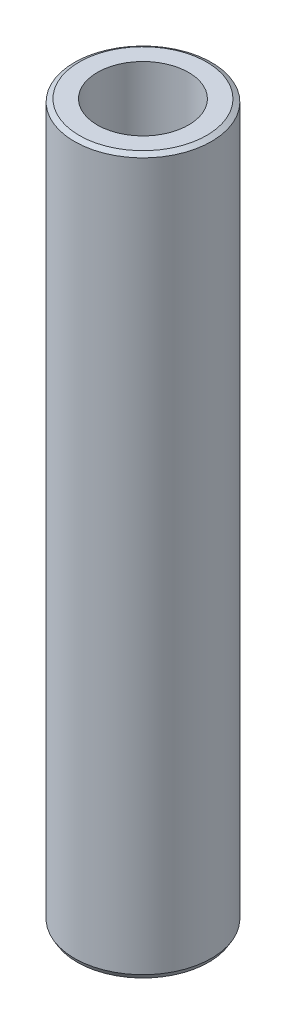
ISO-10303-21;
HEADER;
FILE_DESCRIPTION(('STEP AP214'),'2;1');
FILE_NAME('part.step','',(''),(''),'','','');
FILE_SCHEMA(('AUTOMOTIVE_DESIGN { 1 0 10303 214 1 1 1 1 }'));
ENDSEC;
DATA;
#1=APPLICATION_CONTEXT('core data for automotive mechanical design processes');
#2=APPLICATION_PROTOCOL_DEFINITION('international standard','automotive_design',2000,#1);
#3=PRODUCT_CONTEXT('',#1,'mechanical');
#4=PRODUCT('Part','Part','',(#3));
#5=PRODUCT_RELATED_PRODUCT_CATEGORY('part','',(#4));
#6=PRODUCT_DEFINITION_FORMATION('','',#4);
#7=PRODUCT_DEFINITION_CONTEXT('part definition',#1,'design');
#8=PRODUCT_DEFINITION('design','',#6,#7);
#9=PRODUCT_DEFINITION_SHAPE('','',#8);
#10=(LENGTH_UNIT() NAMED_UNIT(*) SI_UNIT(.MILLI.,.METRE.));
#11=(NAMED_UNIT(*) PLANE_ANGLE_UNIT() SI_UNIT($,.RADIAN.));
#12=(NAMED_UNIT(*) SI_UNIT($,.STERADIAN.) SOLID_ANGLE_UNIT());
#13=UNCERTAINTY_MEASURE_WITH_UNIT(LENGTH_MEASURE(1.E-05),#10,'distance_accuracy_value','');
#14=(GEOMETRIC_REPRESENTATION_CONTEXT(3) GLOBAL_UNCERTAINTY_ASSIGNED_CONTEXT((#13)) GLOBAL_UNIT_ASSIGNED_CONTEXT((#10,
#11,#12)) REPRESENTATION_CONTEXT('',''));
#15=CARTESIAN_POINT('',(0.,0.,0.));
#16=DIRECTION('',(0.,0.,1.));
#17=DIRECTION('',(1.,0.,0.));
#18=AXIS2_PLACEMENT_3D('',#15,#16,#17);
#19=CARTESIAN_POINT('',(0.,600.,0.));
#20=DIRECTION('',(0.,-1.,0.));
#21=DIRECTION('',(0.,0.,-1.));
#22=AXIS2_PLACEMENT_3D('',#19,#20,#21);
#23=CYLINDRICAL_SURFACE('',#22,57.5);
#24=CARTESIAN_POINT('',(0.,597.651810788557,0.));
#25=DIRECTION('',(0.,1.,0.));
#26=DIRECTION('',(0.,0.,1.));
#27=AXIS2_PLACEMENT_3D('',#24,#25,#26);
#28=CIRCLE('',#27,57.5);
#29=CARTESIAN_POINT('',(0.,597.651810788557,57.5));
#30=VERTEX_POINT('',#29);
#31=EDGE_CURVE('E50',#30,#30,#28,.F.);
#32=ORIENTED_EDGE('',*,*,#31,.T.);
#33=EDGE_LOOP('',(#32));
#34=FACE_BOUND('',#33,.T.);
#35=CARTESIAN_POINT('',(0.,4.06718302000464,0.));
#36=DIRECTION('',(0.,1.,0.));
#37=DIRECTION('',(0.,0.,1.));
#38=AXIS2_PLACEMENT_3D('',#35,#36,#37);
#39=CIRCLE('',#38,57.5);
#40=CARTESIAN_POINT('',(0.,4.06718302000464,57.5));
#41=VERTEX_POINT('',#40);
#42=EDGE_CURVE('E51',#41,#41,#39,.T.);
#43=ORIENTED_EDGE('',*,*,#42,.T.);
#44=EDGE_LOOP('',(#43));
#45=FACE_BOUND('',#44,.T.);
#46=ADVANCED_FACE('F39',(#34,#45),#23,.T.);
#47=CARTESIAN_POINT('',(0.,600.,0.));
#48=DIRECTION('',(0.,1.,0.));
#49=DIRECTION('',(0.,0.,1.));
#50=AXIS2_PLACEMENT_3D('',#47,#48,#49);
#51=PLANE('',#50);
#52=CARTESIAN_POINT('',(0.,600.,0.));
#53=DIRECTION('',(0.,1.,0.));
#54=DIRECTION('',(0.,0.,1.));
#55=AXIS2_PLACEMENT_3D('',#52,#53,#54);
#56=CIRCLE('',#55,53.4328169799956);
#57=CARTESIAN_POINT('',(0.,600.,53.4328169799956));
#58=VERTEX_POINT('',#57);
#59=EDGE_CURVE('E54',#58,#58,#56,.T.);
#60=ORIENTED_EDGE('',*,*,#59,.T.);
#61=EDGE_LOOP('',(#60));
#62=FACE_BOUND('',#61,.T.);
#63=CARTESIAN_POINT('',(0.,600.,0.));
#64=DIRECTION('',(0.,1.,0.));
#65=DIRECTION('',(0.,0.,1.));
#66=AXIS2_PLACEMENT_3D('',#63,#64,#65);
#67=CIRCLE('',#66,38.2694167790476);
#68=CARTESIAN_POINT('',(0.,600.,38.2694167790476));
#69=VERTEX_POINT('',#68);
#70=EDGE_CURVE('E58',#69,#69,#67,.T.);
#71=ORIENTED_EDGE('',*,*,#70,.F.);
#72=EDGE_LOOP('',(#71));
#73=FACE_BOUND('',#72,.T.);
#74=ADVANCED_FACE('F69',(#62,#73),#51,.T.);
#75=CARTESIAN_POINT('',(0.,0.,0.));
#76=DIRECTION('',(0.,1.,0.));
#77=DIRECTION('',(0.,0.,1.));
#78=AXIS2_PLACEMENT_3D('',#75,#76,#77);
#79=PLANE('',#78);
#80=CARTESIAN_POINT('',(0.,0.,0.));
#81=DIRECTION('',(0.,1.,0.));
#82=DIRECTION('',(0.,0.,1.));
#83=AXIS2_PLACEMENT_3D('',#80,#81,#82);
#84=CIRCLE('',#83,55.1518107885568);
#85=CARTESIAN_POINT('',(0.,0.,55.1518107885568));
#86=VERTEX_POINT('',#85);
#87=EDGE_CURVE('E10',#86,#86,#84,.F.);
#88=ORIENTED_EDGE('',*,*,#87,.T.);
#89=EDGE_LOOP('',(#88));
#90=FACE_BOUND('',#89,.T.);
#91=CARTESIAN_POINT('',(0.,0.,0.));
#92=DIRECTION('',(0.,1.,0.));
#93=DIRECTION('',(0.,0.,1.));
#94=AXIS2_PLACEMENT_3D('',#91,#92,#93);
#95=CIRCLE('',#94,38.2694167790476);
#96=CARTESIAN_POINT('',(0.,0.,38.2694167790476));
#97=VERTEX_POINT('',#96);
#98=EDGE_CURVE('E63',#97,#97,#95,.T.);
#99=ORIENTED_EDGE('',*,*,#98,.T.);
#100=EDGE_LOOP('',(#99));
#101=FACE_BOUND('',#100,.T.);
#102=ADVANCED_FACE('F75',(#90,#101),#79,.F.);
#103=CARTESIAN_POINT('',(0.,600.,0.));
#104=DIRECTION('',(0.,-1.,0.));
#105=DIRECTION('',(0.,0.,-1.));
#106=AXIS2_PLACEMENT_3D('',#103,#104,#105);
#107=CYLINDRICAL_SURFACE('',#106,38.2694167790476);
#108=ORIENTED_EDGE('',*,*,#70,.T.);
#109=EDGE_LOOP('',(#108));
#110=FACE_BOUND('',#109,.T.);
#111=ORIENTED_EDGE('',*,*,#98,.F.);
#112=EDGE_LOOP('',(#111));
#113=FACE_BOUND('',#112,.T.);
#114=ADVANCED_FACE('F70',(#110,#113),#107,.F.);
#115=CARTESIAN_POINT('',(0.,600.,0.));
#116=DIRECTION('',(0.,-1.,0.));
#117=DIRECTION('',(0.,0.,-1.));
#118=AXIS2_PLACEMENT_3D('',#115,#116,#117);
#119=CONICAL_SURFACE('',#118,53.4328169799956,1.04719755119661);
#120=ORIENTED_EDGE('',*,*,#31,.F.);
#121=EDGE_LOOP('',(#120));
#122=FACE_BOUND('',#121,.T.);
#123=ORIENTED_EDGE('',*,*,#59,.F.);
#124=EDGE_LOOP('',(#123));
#125=FACE_BOUND('',#124,.T.);
#126=ADVANCED_FACE('F81',(#122,#125),#119,.T.);
#127=CARTESIAN_POINT('',(0.,4.06718302000464,0.));
#128=DIRECTION('',(0.,1.,0.));
#129=DIRECTION('',(0.,0.,1.));
#130=AXIS2_PLACEMENT_3D('',#127,#128,#129);
#131=CONICAL_SURFACE('',#130,57.5,0.523598775598308);
#132=ORIENTED_EDGE('',*,*,#87,.F.);
#133=EDGE_LOOP('',(#132));
#134=FACE_BOUND('',#133,.T.);
#135=ORIENTED_EDGE('',*,*,#42,.F.);
#136=EDGE_LOOP('',(#135));
#137=FACE_BOUND('',#136,.T.);
#138=ADVANCED_FACE('F45',(#134,#137),#131,.T.);
#139=CLOSED_SHELL('',(#46,#74,#102,#114,#126,#138));
#140=MANIFOLD_SOLID_BREP('B2',#139);
#141=ADVANCED_BREP_SHAPE_REPRESENTATION('',(#18,#140),#14);
#142=SHAPE_DEFINITION_REPRESENTATION(#9,#141);
ENDSEC;
END-ISO-10303-21;
